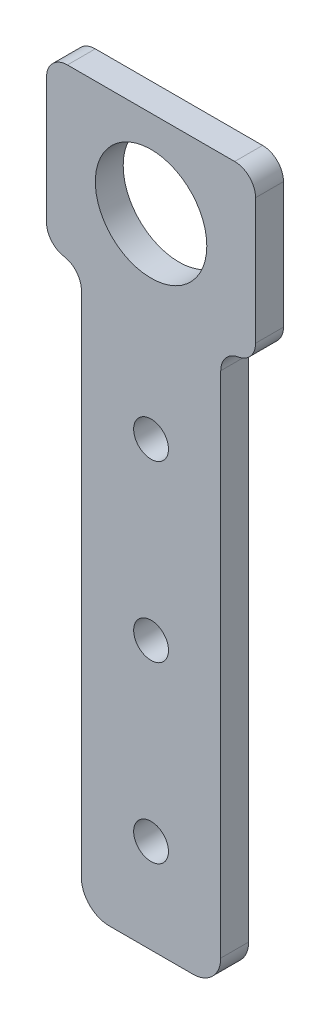
ISO-10303-21;
HEADER;
FILE_DESCRIPTION(('STEP AP214'),'2;1');
FILE_NAME('part.step','',(''),(''),'','','');
FILE_SCHEMA(('AUTOMOTIVE_DESIGN { 1 0 10303 214 1 1 1 1 }'));
ENDSEC;
DATA;
#1=APPLICATION_CONTEXT('core data for automotive mechanical design processes');
#2=APPLICATION_PROTOCOL_DEFINITION('international standard','automotive_design',2000,#1);
#3=PRODUCT_CONTEXT('',#1,'mechanical');
#4=PRODUCT('Part','Part','',(#3));
#5=PRODUCT_RELATED_PRODUCT_CATEGORY('part','',(#4));
#6=PRODUCT_DEFINITION_FORMATION('','',#4);
#7=PRODUCT_DEFINITION_CONTEXT('part definition',#1,'design');
#8=PRODUCT_DEFINITION('design','',#6,#7);
#9=PRODUCT_DEFINITION_SHAPE('','',#8);
#10=(LENGTH_UNIT() NAMED_UNIT(*) SI_UNIT(.MILLI.,.METRE.));
#11=(NAMED_UNIT(*) PLANE_ANGLE_UNIT() SI_UNIT($,.RADIAN.));
#12=(NAMED_UNIT(*) SI_UNIT($,.STERADIAN.) SOLID_ANGLE_UNIT());
#13=UNCERTAINTY_MEASURE_WITH_UNIT(LENGTH_MEASURE(1.E-05),#10,'distance_accuracy_value','');
#14=(GEOMETRIC_REPRESENTATION_CONTEXT(3) GLOBAL_UNCERTAINTY_ASSIGNED_CONTEXT((#13)) GLOBAL_UNIT_ASSIGNED_CONTEXT((#10,
#11,#12)) REPRESENTATION_CONTEXT('',''));
#15=CARTESIAN_POINT('',(0.,0.,0.));
#16=DIRECTION('',(0.,0.,1.));
#17=DIRECTION('',(1.,0.,0.));
#18=AXIS2_PLACEMENT_3D('',#15,#16,#17);
#19=CARTESIAN_POINT('',(-6.,-61.,4.));
#20=DIRECTION('',(0.,0.,-1.));
#21=DIRECTION('',(-1.,0.,0.));
#22=AXIS2_PLACEMENT_3D('',#19,#20,#21);
#23=CYLINDRICAL_SURFACE('',#22,4.);
#24=DIRECTION('',(0.,0.,1.));
#25=VECTOR('',#24,1.);
#26=CARTESIAN_POINT('',(-10.,-61.,4.));
#27=LINE('',#26,#25);
#28=CARTESIAN_POINT('',(-10.,-61.,0.));
#29=VERTEX_POINT('',#28);
#30=CARTESIAN_POINT('',(-10.,-61.,4.));
#31=VERTEX_POINT('',#30);
#32=EDGE_CURVE('E228',#29,#31,#27,.T.);
#33=ORIENTED_EDGE('',*,*,#32,.F.);
#34=CARTESIAN_POINT('',(-6.,-61.,0.));
#35=DIRECTION('',(0.,0.,-1.));
#36=DIRECTION('',(-1.,0.,0.));
#37=AXIS2_PLACEMENT_3D('',#34,#35,#36);
#38=CIRCLE('',#37,4.);
#39=CARTESIAN_POINT('',(-6.,-65.,0.));
#40=VERTEX_POINT('',#39);
#41=EDGE_CURVE('E40',#40,#29,#38,.T.);
#42=ORIENTED_EDGE('',*,*,#41,.F.);
#43=DIRECTION('',(0.,0.,1.));
#44=VECTOR('',#43,1.);
#45=CARTESIAN_POINT('',(-6.,-65.,4.));
#46=LINE('',#45,#44);
#47=CARTESIAN_POINT('',(-6.,-65.,4.));
#48=VERTEX_POINT('',#47);
#49=EDGE_CURVE('E231',#48,#40,#46,.F.);
#50=ORIENTED_EDGE('',*,*,#49,.F.);
#51=CARTESIAN_POINT('',(-6.,-61.,4.));
#52=DIRECTION('',(0.,0.,-1.));
#53=DIRECTION('',(-1.,0.,0.));
#54=AXIS2_PLACEMENT_3D('',#51,#52,#53);
#55=CIRCLE('',#54,4.);
#56=EDGE_CURVE('E11',#31,#48,#55,.F.);
#57=ORIENTED_EDGE('',*,*,#56,.F.);
#58=EDGE_LOOP('',(#33,#42,#50,#57));
#59=FACE_BOUND('',#58,.T.);
#60=ADVANCED_FACE('F33',(#59),#23,.T.);
#61=CARTESIAN_POINT('',(6.,-61.,-53.851648071345));
#62=DIRECTION('',(0.,0.,-1.));
#63=DIRECTION('',(-1.,0.,0.));
#64=AXIS2_PLACEMENT_3D('',#61,#62,#63);
#65=CYLINDRICAL_SURFACE('',#64,4.);
#66=DIRECTION('',(0.,0.,1.));
#67=VECTOR('',#66,1.);
#68=CARTESIAN_POINT('',(6.,-65.,-53.851648071345));
#69=LINE('',#68,#67);
#70=CARTESIAN_POINT('',(6.,-65.,0.));
#71=VERTEX_POINT('',#70);
#72=CARTESIAN_POINT('',(6.,-65.,4.));
#73=VERTEX_POINT('',#72);
#74=EDGE_CURVE('E212',#71,#73,#69,.T.);
#75=ORIENTED_EDGE('',*,*,#74,.F.);
#76=CARTESIAN_POINT('',(6.,-61.,0.));
#77=DIRECTION('',(0.,0.,-1.));
#78=DIRECTION('',(-1.,0.,0.));
#79=AXIS2_PLACEMENT_3D('',#76,#77,#78);
#80=CIRCLE('',#79,4.);
#81=CARTESIAN_POINT('',(10.,-61.,0.));
#82=VERTEX_POINT('',#81);
#83=EDGE_CURVE('E224',#82,#71,#80,.T.);
#84=ORIENTED_EDGE('',*,*,#83,.F.);
#85=DIRECTION('',(0.,0.,1.));
#86=VECTOR('',#85,1.);
#87=CARTESIAN_POINT('',(10.,-61.,-53.851648071345));
#88=LINE('',#87,#86);
#89=CARTESIAN_POINT('',(10.,-61.,4.));
#90=VERTEX_POINT('',#89);
#91=EDGE_CURVE('E139',#90,#82,#88,.F.);
#92=ORIENTED_EDGE('',*,*,#91,.F.);
#93=CARTESIAN_POINT('',(6.,-61.,4.));
#94=DIRECTION('',(0.,0.,-1.));
#95=DIRECTION('',(-1.,0.,0.));
#96=AXIS2_PLACEMENT_3D('',#93,#94,#95);
#97=CIRCLE('',#96,4.);
#98=EDGE_CURVE('E226',#73,#90,#97,.F.);
#99=ORIENTED_EDGE('',*,*,#98,.F.);
#100=EDGE_LOOP('',(#75,#84,#92,#99));
#101=FACE_BOUND('',#100,.T.);
#102=ADVANCED_FACE('F277',(#101),#65,.T.);
#103=CARTESIAN_POINT('',(0.,0.,4.));
#104=DIRECTION('',(0.,0.,-1.));
#105=DIRECTION('',(-1.,0.,0.));
#106=AXIS2_PLACEMENT_3D('',#103,#104,#105);
#107=PLANE('',#106);
#108=CARTESIAN_POINT('',(0.,-26.5,4.));
#109=DIRECTION('',(0.,0.,1.));
#110=DIRECTION('',(1.,0.,0.));
#111=AXIS2_PLACEMENT_3D('',#108,#109,#110);
#112=CIRCLE('',#111,2.5);
#113=CARTESIAN_POINT('',(2.5,-26.5,4.));
#114=VERTEX_POINT('',#113);
#115=EDGE_CURVE('E217',#114,#114,#112,.T.);
#116=ORIENTED_EDGE('',*,*,#115,.F.);
#117=EDGE_LOOP('',(#116));
#118=FACE_BOUND('',#117,.T.);
#119=CARTESIAN_POINT('',(0.,-51.5,4.));
#120=DIRECTION('',(0.,0.,1.));
#121=DIRECTION('',(1.,0.,0.));
#122=AXIS2_PLACEMENT_3D('',#119,#120,#121);
#123=CIRCLE('',#122,2.5);
#124=CARTESIAN_POINT('',(2.50000000000001,-51.5,4.));
#125=VERTEX_POINT('',#124);
#126=EDGE_CURVE('E266',#125,#125,#123,.T.);
#127=ORIENTED_EDGE('',*,*,#126,.F.);
#128=EDGE_LOOP('',(#127));
#129=FACE_BOUND('',#128,.T.);
#130=CARTESIAN_POINT('',(0.,-1.5,4.));
#131=DIRECTION('',(0.,0.,1.));
#132=DIRECTION('',(1.,0.,0.));
#133=AXIS2_PLACEMENT_3D('',#130,#131,#132);
#134=CIRCLE('',#133,2.5);
#135=CARTESIAN_POINT('',(2.5,-1.5,4.));
#136=VERTEX_POINT('',#135);
#137=EDGE_CURVE('E259',#136,#136,#134,.T.);
#138=ORIENTED_EDGE('',*,*,#137,.F.);
#139=EDGE_LOOP('',(#138));
#140=FACE_BOUND('',#139,.T.);
#141=CARTESIAN_POINT('',(0.,26.5,4.));
#142=DIRECTION('',(0.,0.,1.));
#143=DIRECTION('',(1.,0.,0.));
#144=AXIS2_PLACEMENT_3D('',#141,#142,#143);
#145=CIRCLE('',#144,8.);
#146=CARTESIAN_POINT('',(8.,26.5,4.));
#147=VERTEX_POINT('',#146);
#148=EDGE_CURVE('E177',#147,#147,#145,.T.);
#149=ORIENTED_EDGE('',*,*,#148,.F.);
#150=EDGE_LOOP('',(#149));
#151=FACE_BOUND('',#150,.T.);
#152=DIRECTION('',(0.,-1.,0.));
#153=VECTOR('',#152,1.);
#154=CARTESIAN_POINT('',(-10.,-15.,4.));
#155=LINE('',#154,#153);
#156=CARTESIAN_POINT('',(-10.,12.,4.));
#157=VERTEX_POINT('',#156);
#158=EDGE_CURVE('E158',#157,#31,#155,.T.);
#159=ORIENTED_EDGE('',*,*,#158,.T.);
#160=ORIENTED_EDGE('',*,*,#56,.T.);
#161=DIRECTION('',(1.,0.,0.));
#162=VECTOR('',#161,1.);
#163=CARTESIAN_POINT('',(10.,-65.,4.));
#164=LINE('',#163,#162);
#165=EDGE_CURVE('E220',#48,#73,#164,.T.);
#166=ORIENTED_EDGE('',*,*,#165,.T.);
#167=ORIENTED_EDGE('',*,*,#98,.T.);
#168=DIRECTION('',(0.,1.,0.));
#169=VECTOR('',#168,1.);
#170=CARTESIAN_POINT('',(10.,-15.,4.));
#171=LINE('',#170,#169);
#172=CARTESIAN_POINT('',(10.,12.,4.));
#173=VERTEX_POINT('',#172);
#174=EDGE_CURVE('E162',#90,#173,#171,.T.);
#175=ORIENTED_EDGE('',*,*,#174,.T.);
#176=CARTESIAN_POINT('',(13.,12.,4.));
#177=DIRECTION('',(0.,0.,-1.));
#178=DIRECTION('',(-1.,0.,0.));
#179=AXIS2_PLACEMENT_3D('',#176,#177,#178);
#180=CIRCLE('',#179,3.);
#181=CARTESIAN_POINT('',(12.5,14.9580398915498,4.));
#182=VERTEX_POINT('',#181);
#183=EDGE_CURVE('E153',#173,#182,#180,.T.);
#184=ORIENTED_EDGE('',*,*,#183,.T.);
#185=CARTESIAN_POINT('',(12.,17.9160797830996,4.));
#186=DIRECTION('',(0.,0.,-1.));
#187=DIRECTION('',(-1.,0.,0.));
#188=AXIS2_PLACEMENT_3D('',#185,#186,#187);
#189=CIRCLE('',#188,3.);
#190=CARTESIAN_POINT('',(15.,17.9160797830996,4.));
#191=VERTEX_POINT('',#190);
#192=EDGE_CURVE('E197',#182,#191,#189,.F.);
#193=ORIENTED_EDGE('',*,*,#192,.T.);
#194=DIRECTION('',(0.,-1.,0.));
#195=VECTOR('',#194,1.);
#196=CARTESIAN_POINT('',(15.,39.,4.));
#197=LINE('',#196,#195);
#198=CARTESIAN_POINT('',(15.,36.,4.));
#199=VERTEX_POINT('',#198);
#200=EDGE_CURVE('E248',#199,#191,#197,.T.);
#201=ORIENTED_EDGE('',*,*,#200,.F.);
#202=CARTESIAN_POINT('',(12.,36.,4.));
#203=DIRECTION('',(0.,0.,-1.));
#204=DIRECTION('',(-1.,0.,0.));
#205=AXIS2_PLACEMENT_3D('',#202,#203,#204);
#206=CIRCLE('',#205,3.);
#207=CARTESIAN_POINT('',(12.,39.,4.));
#208=VERTEX_POINT('',#207);
#209=EDGE_CURVE('E195',#199,#208,#206,.F.);
#210=ORIENTED_EDGE('',*,*,#209,.T.);
#211=DIRECTION('',(1.,0.,0.));
#212=VECTOR('',#211,1.);
#213=CARTESIAN_POINT('',(-15.,39.,4.));
#214=LINE('',#213,#212);
#215=CARTESIAN_POINT('',(-12.,39.,4.));
#216=VERTEX_POINT('',#215);
#217=EDGE_CURVE('E251',#216,#208,#214,.T.);
#218=ORIENTED_EDGE('',*,*,#217,.F.);
#219=CARTESIAN_POINT('',(-12.,36.,4.));
#220=DIRECTION('',(0.,0.,-1.));
#221=DIRECTION('',(-1.,0.,0.));
#222=AXIS2_PLACEMENT_3D('',#219,#220,#221);
#223=CIRCLE('',#222,3.);
#224=CARTESIAN_POINT('',(-15.,36.,4.));
#225=VERTEX_POINT('',#224);
#226=EDGE_CURVE('E193',#216,#225,#223,.F.);
#227=ORIENTED_EDGE('',*,*,#226,.T.);
#228=DIRECTION('',(0.,-1.,0.));
#229=VECTOR('',#228,1.);
#230=CARTESIAN_POINT('',(-15.,39.,4.));
#231=LINE('',#230,#229);
#232=CARTESIAN_POINT('',(-15.,17.9160797830996,4.));
#233=VERTEX_POINT('',#232);
#234=EDGE_CURVE('E245',#225,#233,#231,.T.);
#235=ORIENTED_EDGE('',*,*,#234,.T.);
#236=CARTESIAN_POINT('',(-12.,17.9160797830996,4.));
#237=DIRECTION('',(0.,0.,-1.));
#238=DIRECTION('',(-1.,0.,0.));
#239=AXIS2_PLACEMENT_3D('',#236,#237,#238);
#240=CIRCLE('',#239,3.);
#241=CARTESIAN_POINT('',(-12.5,14.9580398915498,4.));
#242=VERTEX_POINT('',#241);
#243=EDGE_CURVE('E191',#233,#242,#240,.F.);
#244=ORIENTED_EDGE('',*,*,#243,.T.);
#245=CARTESIAN_POINT('',(-13.,12.,4.));
#246=DIRECTION('',(0.,0.,-1.));
#247=DIRECTION('',(-1.,0.,0.));
#248=AXIS2_PLACEMENT_3D('',#245,#246,#247);
#249=CIRCLE('',#248,3.);
#250=EDGE_CURVE('E170',#242,#157,#249,.T.);
#251=ORIENTED_EDGE('',*,*,#250,.T.);
#252=EDGE_LOOP('',(#159,#160,#166,#167,#175,#184,#193,#201,#210,#218,#227,#235,#244,#251));
#253=FACE_BOUND('',#252,.T.);
#254=ADVANCED_FACE('F274',(#118,#129,#140,#151,#253),#107,.F.);
#255=CARTESIAN_POINT('',(0.,0.,0.));
#256=DIRECTION('',(0.,0.,-1.));
#257=DIRECTION('',(-1.,0.,0.));
#258=AXIS2_PLACEMENT_3D('',#255,#256,#257);
#259=PLANE('',#258);
#260=CARTESIAN_POINT('',(0.,-26.5,0.));
#261=DIRECTION('',(0.,0.,-1.));
#262=DIRECTION('',(-1.,0.,0.));
#263=AXIS2_PLACEMENT_3D('',#260,#261,#262);
#264=CIRCLE('',#263,2.5);
#265=CARTESIAN_POINT('',(-2.5,-26.5,0.));
#266=VERTEX_POINT('',#265);
#267=EDGE_CURVE('E216',#266,#266,#264,.T.);
#268=ORIENTED_EDGE('',*,*,#267,.F.);
#269=EDGE_LOOP('',(#268));
#270=FACE_BOUND('',#269,.T.);
#271=CARTESIAN_POINT('',(0.,-51.5,0.));
#272=DIRECTION('',(0.,0.,-1.));
#273=DIRECTION('',(-1.,0.,0.));
#274=AXIS2_PLACEMENT_3D('',#271,#272,#273);
#275=CIRCLE('',#274,2.5);
#276=CARTESIAN_POINT('',(-2.49999999999999,-51.5,0.));
#277=VERTEX_POINT('',#276);
#278=EDGE_CURVE('E213',#277,#277,#275,.T.);
#279=ORIENTED_EDGE('',*,*,#278,.F.);
#280=EDGE_LOOP('',(#279));
#281=FACE_BOUND('',#280,.T.);
#282=CARTESIAN_POINT('',(0.,-1.5,0.));
#283=DIRECTION('',(0.,0.,1.));
#284=DIRECTION('',(1.,0.,0.));
#285=AXIS2_PLACEMENT_3D('',#282,#283,#284);
#286=CIRCLE('',#285,2.5);
#287=CARTESIAN_POINT('',(2.5,-1.5,0.));
#288=VERTEX_POINT('',#287);
#289=EDGE_CURVE('E258',#288,#288,#286,.T.);
#290=ORIENTED_EDGE('',*,*,#289,.T.);
#291=EDGE_LOOP('',(#290));
#292=FACE_BOUND('',#291,.T.);
#293=CARTESIAN_POINT('',(0.,26.5,0.));
#294=DIRECTION('',(0.,0.,-1.));
#295=DIRECTION('',(-1.,0.,0.));
#296=AXIS2_PLACEMENT_3D('',#293,#294,#295);
#297=CIRCLE('',#296,8.);
#298=CARTESIAN_POINT('',(-8.,26.5,0.));
#299=VERTEX_POINT('',#298);
#300=EDGE_CURVE('E173',#299,#299,#297,.T.);
#301=ORIENTED_EDGE('',*,*,#300,.F.);
#302=EDGE_LOOP('',(#301));
#303=FACE_BOUND('',#302,.T.);
#304=DIRECTION('',(1.,0.,0.));
#305=VECTOR('',#304,1.);
#306=CARTESIAN_POINT('',(10.,-65.,0.));
#307=LINE('',#306,#305);
#308=EDGE_CURVE('E234',#40,#71,#307,.T.);
#309=ORIENTED_EDGE('',*,*,#308,.F.);
#310=ORIENTED_EDGE('',*,*,#41,.T.);
#311=DIRECTION('',(0.,-1.,0.));
#312=VECTOR('',#311,1.);
#313=CARTESIAN_POINT('',(-10.,-15.,0.));
#314=LINE('',#313,#312);
#315=CARTESIAN_POINT('',(-10.,12.,0.));
#316=VERTEX_POINT('',#315);
#317=EDGE_CURVE('E142',#316,#29,#314,.T.);
#318=ORIENTED_EDGE('',*,*,#317,.F.);
#319=CARTESIAN_POINT('',(-13.,12.,0.));
#320=DIRECTION('',(0.,0.,-1.));
#321=DIRECTION('',(-1.,0.,0.));
#322=AXIS2_PLACEMENT_3D('',#319,#320,#321);
#323=CIRCLE('',#322,3.);
#324=CARTESIAN_POINT('',(-12.5,14.9580398915498,0.));
#325=VERTEX_POINT('',#324);
#326=EDGE_CURVE('E167',#316,#325,#323,.F.);
#327=ORIENTED_EDGE('',*,*,#326,.T.);
#328=CARTESIAN_POINT('',(-12.,17.9160797830996,0.));
#329=DIRECTION('',(0.,0.,-1.));
#330=DIRECTION('',(-1.,0.,0.));
#331=AXIS2_PLACEMENT_3D('',#328,#329,#330);
#332=CIRCLE('',#331,3.);
#333=CARTESIAN_POINT('',(-15.,17.9160797830996,0.));
#334=VERTEX_POINT('',#333);
#335=EDGE_CURVE('E182',#325,#334,#332,.T.);
#336=ORIENTED_EDGE('',*,*,#335,.T.);
#337=DIRECTION('',(0.,-1.,0.));
#338=VECTOR('',#337,1.);
#339=CARTESIAN_POINT('',(-15.,39.,0.));
#340=LINE('',#339,#338);
#341=CARTESIAN_POINT('',(-15.,36.,0.));
#342=VERTEX_POINT('',#341);
#343=EDGE_CURVE('E242',#342,#334,#340,.T.);
#344=ORIENTED_EDGE('',*,*,#343,.F.);
#345=CARTESIAN_POINT('',(-12.,36.,0.));
#346=DIRECTION('',(0.,0.,-1.));
#347=DIRECTION('',(-1.,0.,0.));
#348=AXIS2_PLACEMENT_3D('',#345,#346,#347);
#349=CIRCLE('',#348,3.);
#350=CARTESIAN_POINT('',(-12.,39.,0.));
#351=VERTEX_POINT('',#350);
#352=EDGE_CURVE('E184',#342,#351,#349,.T.);
#353=ORIENTED_EDGE('',*,*,#352,.T.);
#354=DIRECTION('',(-1.,0.,0.));
#355=VECTOR('',#354,1.);
#356=CARTESIAN_POINT('',(-15.,39.,0.));
#357=LINE('',#356,#355);
#358=CARTESIAN_POINT('',(12.,39.,0.));
#359=VERTEX_POINT('',#358);
#360=EDGE_CURVE('E176',#359,#351,#357,.T.);
#361=ORIENTED_EDGE('',*,*,#360,.F.);
#362=CARTESIAN_POINT('',(12.,36.,0.));
#363=DIRECTION('',(0.,0.,-1.));
#364=DIRECTION('',(-1.,0.,0.));
#365=AXIS2_PLACEMENT_3D('',#362,#363,#364);
#366=CIRCLE('',#365,3.);
#367=CARTESIAN_POINT('',(15.,36.,0.));
#368=VERTEX_POINT('',#367);
#369=EDGE_CURVE('E186',#359,#368,#366,.T.);
#370=ORIENTED_EDGE('',*,*,#369,.T.);
#371=DIRECTION('',(0.,-1.,0.));
#372=VECTOR('',#371,1.);
#373=CARTESIAN_POINT('',(15.,39.,0.));
#374=LINE('',#373,#372);
#375=CARTESIAN_POINT('',(15.,17.9160797830996,0.));
#376=VERTEX_POINT('',#375);
#377=EDGE_CURVE('E143',#368,#376,#374,.T.);
#378=ORIENTED_EDGE('',*,*,#377,.T.);
#379=CARTESIAN_POINT('',(12.,17.9160797830996,0.));
#380=DIRECTION('',(0.,0.,-1.));
#381=DIRECTION('',(-1.,0.,0.));
#382=AXIS2_PLACEMENT_3D('',#379,#380,#381);
#383=CIRCLE('',#382,3.);
#384=CARTESIAN_POINT('',(12.5,14.9580398915498,0.));
#385=VERTEX_POINT('',#384);
#386=EDGE_CURVE('E150',#376,#385,#383,.T.);
#387=ORIENTED_EDGE('',*,*,#386,.T.);
#388=CARTESIAN_POINT('',(13.,12.,0.));
#389=DIRECTION('',(0.,0.,-1.));
#390=DIRECTION('',(-1.,0.,0.));
#391=AXIS2_PLACEMENT_3D('',#388,#389,#390);
#392=CIRCLE('',#391,3.);
#393=CARTESIAN_POINT('',(10.,12.,0.));
#394=VERTEX_POINT('',#393);
#395=EDGE_CURVE('E146',#385,#394,#392,.F.);
#396=ORIENTED_EDGE('',*,*,#395,.T.);
#397=DIRECTION('',(0.,1.,0.));
#398=VECTOR('',#397,1.);
#399=CARTESIAN_POINT('',(10.,-15.,0.));
#400=LINE('',#399,#398);
#401=EDGE_CURVE('E131',#82,#394,#400,.T.);
#402=ORIENTED_EDGE('',*,*,#401,.F.);
#403=ORIENTED_EDGE('',*,*,#83,.T.);
#404=EDGE_LOOP('',(#309,#310,#318,#327,#336,#344,#353,#361,#370,#378,#387,#396,#402,#403));
#405=FACE_BOUND('',#404,.T.);
#406=ADVANCED_FACE('F148',(#270,#281,#292,#303,#405),#259,.T.);
#407=CARTESIAN_POINT('',(10.,-15.,4.));
#408=DIRECTION('',(-1.,0.,0.));
#409=DIRECTION('',(0.,0.,1.));
#410=AXIS2_PLACEMENT_3D('',#407,#408,#409);
#411=PLANE('',#410);
#412=ORIENTED_EDGE('',*,*,#174,.F.);
#413=ORIENTED_EDGE('',*,*,#91,.T.);
#414=ORIENTED_EDGE('',*,*,#401,.T.);
#415=DIRECTION('',(0.,0.,-1.));
#416=VECTOR('',#415,1.);
#417=CARTESIAN_POINT('',(10.,12.,4.));
#418=LINE('',#417,#416);
#419=EDGE_CURVE('E136',#394,#173,#418,.F.);
#420=ORIENTED_EDGE('',*,*,#419,.T.);
#421=EDGE_LOOP('',(#412,#413,#414,#420));
#422=FACE_BOUND('',#421,.T.);
#423=ADVANCED_FACE('F134',(#422),#411,.F.);
#424=CARTESIAN_POINT('',(-10.,-15.,4.));
#425=DIRECTION('',(1.,0.,0.));
#426=DIRECTION('',(0.,0.,-1.));
#427=AXIS2_PLACEMENT_3D('',#424,#425,#426);
#428=PLANE('',#427);
#429=ORIENTED_EDGE('',*,*,#317,.T.);
#430=ORIENTED_EDGE('',*,*,#32,.T.);
#431=ORIENTED_EDGE('',*,*,#158,.F.);
#432=DIRECTION('',(0.,0.,-1.));
#433=VECTOR('',#432,1.);
#434=CARTESIAN_POINT('',(-10.,12.,0.));
#435=LINE('',#434,#433);
#436=EDGE_CURVE('E154',#157,#316,#435,.T.);
#437=ORIENTED_EDGE('',*,*,#436,.T.);
#438=EDGE_LOOP('',(#429,#430,#431,#437));
#439=FACE_BOUND('',#438,.T.);
#440=ADVANCED_FACE('F237',(#439),#428,.F.);
#441=CARTESIAN_POINT('',(15.,39.,0.));
#442=DIRECTION('',(-1.,0.,0.));
#443=DIRECTION('',(0.,0.,1.));
#444=AXIS2_PLACEMENT_3D('',#441,#442,#443);
#445=PLANE('',#444);
#446=ORIENTED_EDGE('',*,*,#200,.T.);
#447=DIRECTION('',(0.,0.,1.));
#448=VECTOR('',#447,1.);
#449=CARTESIAN_POINT('',(15.,17.9160797830996,0.));
#450=LINE('',#449,#448);
#451=EDGE_CURVE('E179',#191,#376,#450,.F.);
#452=ORIENTED_EDGE('',*,*,#451,.T.);
#453=ORIENTED_EDGE('',*,*,#377,.F.);
#454=DIRECTION('',(0.,0.,-1.));
#455=VECTOR('',#454,1.);
#456=CARTESIAN_POINT('',(15.,36.,4.));
#457=LINE('',#456,#455);
#458=EDGE_CURVE('E172',#368,#199,#457,.F.);
#459=ORIENTED_EDGE('',*,*,#458,.T.);
#460=EDGE_LOOP('',(#446,#452,#453,#459));
#461=FACE_BOUND('',#460,.T.);
#462=ADVANCED_FACE('F310',(#461),#445,.F.);
#463=CARTESIAN_POINT('',(-15.,39.,0.));
#464=DIRECTION('',(1.,0.,0.));
#465=DIRECTION('',(0.,0.,-1.));
#466=AXIS2_PLACEMENT_3D('',#463,#464,#465);
#467=PLANE('',#466);
#468=ORIENTED_EDGE('',*,*,#234,.F.);
#469=DIRECTION('',(0.,0.,1.));
#470=VECTOR('',#469,1.);
#471=CARTESIAN_POINT('',(-15.,36.,0.));
#472=LINE('',#471,#470);
#473=EDGE_CURVE('E208',#225,#342,#472,.F.);
#474=ORIENTED_EDGE('',*,*,#473,.T.);
#475=ORIENTED_EDGE('',*,*,#343,.T.);
#476=DIRECTION('',(0.,0.,1.));
#477=VECTOR('',#476,1.);
#478=CARTESIAN_POINT('',(-15.,17.9160797830996,0.));
#479=LINE('',#478,#477);
#480=EDGE_CURVE('E205',#334,#233,#479,.T.);
#481=ORIENTED_EDGE('',*,*,#480,.T.);
#482=EDGE_LOOP('',(#468,#474,#475,#481));
#483=FACE_BOUND('',#482,.T.);
#484=ADVANCED_FACE('F295',(#483),#467,.F.);
#485=CARTESIAN_POINT('',(0.,39.,0.));
#486=DIRECTION('',(0.,1.,0.));
#487=DIRECTION('',(0.,0.,1.));
#488=AXIS2_PLACEMENT_3D('',#485,#486,#487);
#489=PLANE('',#488);
#490=ORIENTED_EDGE('',*,*,#217,.T.);
#491=DIRECTION('',(0.,0.,-1.));
#492=VECTOR('',#491,1.);
#493=CARTESIAN_POINT('',(12.,39.,0.));
#494=LINE('',#493,#492);
#495=EDGE_CURVE('E202',#208,#359,#494,.T.);
#496=ORIENTED_EDGE('',*,*,#495,.T.);
#497=ORIENTED_EDGE('',*,*,#360,.T.);
#498=DIRECTION('',(0.,0.,1.));
#499=VECTOR('',#498,1.);
#500=CARTESIAN_POINT('',(-12.,39.,4.));
#501=LINE('',#500,#499);
#502=EDGE_CURVE('E199',#351,#216,#501,.T.);
#503=ORIENTED_EDGE('',*,*,#502,.T.);
#504=EDGE_LOOP('',(#490,#496,#497,#503));
#505=FACE_BOUND('',#504,.T.);
#506=ADVANCED_FACE('F303',(#505),#489,.T.);
#507=CARTESIAN_POINT('',(13.,12.,0.));
#508=DIRECTION('',(0.,0.,1.));
#509=DIRECTION('',(1.,0.,0.));
#510=AXIS2_PLACEMENT_3D('',#507,#508,#509);
#511=CYLINDRICAL_SURFACE('',#510,3.);
#512=ORIENTED_EDGE('',*,*,#395,.F.);
#513=DIRECTION('',(0.,0.,1.));
#514=VECTOR('',#513,1.);
#515=CARTESIAN_POINT('',(12.5,14.9580398915498,0.));
#516=LINE('',#515,#514);
#517=EDGE_CURVE('E189',#385,#182,#516,.T.);
#518=ORIENTED_EDGE('',*,*,#517,.T.);
#519=ORIENTED_EDGE('',*,*,#183,.F.);
#520=ORIENTED_EDGE('',*,*,#419,.F.);
#521=EDGE_LOOP('',(#512,#518,#519,#520));
#522=FACE_BOUND('',#521,.T.);
#523=ADVANCED_FACE('F156',(#522),#511,.F.);
#524=CARTESIAN_POINT('',(-13.,12.,4.));
#525=DIRECTION('',(0.,0.,1.));
#526=DIRECTION('',(1.,0.,0.));
#527=AXIS2_PLACEMENT_3D('',#524,#525,#526);
#528=CYLINDRICAL_SURFACE('',#527,3.);
#529=ORIENTED_EDGE('',*,*,#250,.F.);
#530=DIRECTION('',(0.,0.,1.));
#531=VECTOR('',#530,1.);
#532=CARTESIAN_POINT('',(-12.5,14.9580398915498,4.));
#533=LINE('',#532,#531);
#534=EDGE_CURVE('E210',#242,#325,#533,.F.);
#535=ORIENTED_EDGE('',*,*,#534,.T.);
#536=ORIENTED_EDGE('',*,*,#326,.F.);
#537=ORIENTED_EDGE('',*,*,#436,.F.);
#538=EDGE_LOOP('',(#529,#535,#536,#537));
#539=FACE_BOUND('',#538,.T.);
#540=ADVANCED_FACE('F286',(#539),#528,.F.);
#541=CARTESIAN_POINT('',(0.,26.5,-20.));
#542=DIRECTION('',(0.,0.,1.));
#543=DIRECTION('',(1.,0.,0.));
#544=AXIS2_PLACEMENT_3D('',#541,#542,#543);
#545=CYLINDRICAL_SURFACE('',#544,8.);
#546=ORIENTED_EDGE('',*,*,#300,.T.);
#547=EDGE_LOOP('',(#546));
#548=FACE_BOUND('',#547,.T.);
#549=ORIENTED_EDGE('',*,*,#148,.T.);
#550=EDGE_LOOP('',(#549));
#551=FACE_BOUND('',#550,.T.);
#552=ADVANCED_FACE('F319',(#548,#551),#545,.F.);
#553=CARTESIAN_POINT('',(12.,17.9160797830996,0.));
#554=DIRECTION('',(0.,0.,1.));
#555=DIRECTION('',(1.,0.,0.));
#556=AXIS2_PLACEMENT_3D('',#553,#554,#555);
#557=CYLINDRICAL_SURFACE('',#556,3.);
#558=ORIENTED_EDGE('',*,*,#192,.F.);
#559=ORIENTED_EDGE('',*,*,#517,.F.);
#560=ORIENTED_EDGE('',*,*,#386,.F.);
#561=ORIENTED_EDGE('',*,*,#451,.F.);
#562=EDGE_LOOP('',(#558,#559,#560,#561));
#563=FACE_BOUND('',#562,.T.);
#564=ADVANCED_FACE('F317',(#563),#557,.T.);
#565=CARTESIAN_POINT('',(12.,36.,0.));
#566=DIRECTION('',(0.,0.,1.));
#567=DIRECTION('',(1.,0.,0.));
#568=AXIS2_PLACEMENT_3D('',#565,#566,#567);
#569=CYLINDRICAL_SURFACE('',#568,3.);
#570=ORIENTED_EDGE('',*,*,#209,.F.);
#571=ORIENTED_EDGE('',*,*,#458,.F.);
#572=ORIENTED_EDGE('',*,*,#369,.F.);
#573=ORIENTED_EDGE('',*,*,#495,.F.);
#574=EDGE_LOOP('',(#570,#571,#572,#573));
#575=FACE_BOUND('',#574,.T.);
#576=ADVANCED_FACE('F314',(#575),#569,.T.);
#577=CARTESIAN_POINT('',(-12.,36.,0.));
#578=DIRECTION('',(0.,0.,-1.));
#579=DIRECTION('',(-1.,0.,0.));
#580=AXIS2_PLACEMENT_3D('',#577,#578,#579);
#581=CYLINDRICAL_SURFACE('',#580,3.);
#582=ORIENTED_EDGE('',*,*,#352,.F.);
#583=ORIENTED_EDGE('',*,*,#473,.F.);
#584=ORIENTED_EDGE('',*,*,#226,.F.);
#585=ORIENTED_EDGE('',*,*,#502,.F.);
#586=EDGE_LOOP('',(#582,#583,#584,#585));
#587=FACE_BOUND('',#586,.T.);
#588=ADVANCED_FACE('F301',(#587),#581,.T.);
#589=CARTESIAN_POINT('',(-12.,17.9160797830996,4.));
#590=DIRECTION('',(0.,0.,1.));
#591=DIRECTION('',(1.,0.,0.));
#592=AXIS2_PLACEMENT_3D('',#589,#590,#591);
#593=CYLINDRICAL_SURFACE('',#592,3.);
#594=ORIENTED_EDGE('',*,*,#335,.F.);
#595=ORIENTED_EDGE('',*,*,#534,.F.);
#596=ORIENTED_EDGE('',*,*,#243,.F.);
#597=ORIENTED_EDGE('',*,*,#480,.F.);
#598=EDGE_LOOP('',(#594,#595,#596,#597));
#599=FACE_BOUND('',#598,.T.);
#600=ADVANCED_FACE('F292',(#599),#593,.T.);
#601=CARTESIAN_POINT('',(0.,-1.5,0.));
#602=DIRECTION('',(0.,0.,1.));
#603=DIRECTION('',(1.,0.,0.));
#604=AXIS2_PLACEMENT_3D('',#601,#602,#603);
#605=CYLINDRICAL_SURFACE('',#604,2.5);
#606=ORIENTED_EDGE('',*,*,#289,.F.);
#607=EDGE_LOOP('',(#606));
#608=FACE_BOUND('',#607,.T.);
#609=ORIENTED_EDGE('',*,*,#137,.T.);
#610=EDGE_LOOP('',(#609));
#611=FACE_BOUND('',#610,.T.);
#612=ADVANCED_FACE('F340',(#608,#611),#605,.F.);
#613=CARTESIAN_POINT('',(10.,-65.,-53.851648071345));
#614=DIRECTION('',(0.,-1.,0.));
#615=DIRECTION('',(0.,0.,-1.));
#616=AXIS2_PLACEMENT_3D('',#613,#614,#615);
#617=PLANE('',#616);
#618=ORIENTED_EDGE('',*,*,#165,.F.);
#619=ORIENTED_EDGE('',*,*,#49,.T.);
#620=ORIENTED_EDGE('',*,*,#308,.T.);
#621=ORIENTED_EDGE('',*,*,#74,.T.);
#622=EDGE_LOOP('',(#618,#619,#620,#621));
#623=FACE_BOUND('',#622,.T.);
#624=ADVANCED_FACE('F360',(#623),#617,.T.);
#625=CARTESIAN_POINT('',(0.,-51.5,-6.));
#626=DIRECTION('',(0.,0.,1.));
#627=DIRECTION('',(1.,0.,0.));
#628=AXIS2_PLACEMENT_3D('',#625,#626,#627);
#629=CYLINDRICAL_SURFACE('',#628,2.5);
#630=ORIENTED_EDGE('',*,*,#278,.T.);
#631=EDGE_LOOP('',(#630));
#632=FACE_BOUND('',#631,.T.);
#633=ORIENTED_EDGE('',*,*,#126,.T.);
#634=EDGE_LOOP('',(#633));
#635=FACE_BOUND('',#634,.T.);
#636=ADVANCED_FACE('F370',(#632,#635),#629,.F.);
#637=CARTESIAN_POINT('',(0.,-26.5,-6.));
#638=DIRECTION('',(0.,0.,1.));
#639=DIRECTION('',(1.,0.,0.));
#640=AXIS2_PLACEMENT_3D('',#637,#638,#639);
#641=CYLINDRICAL_SURFACE('',#640,2.5);
#642=ORIENTED_EDGE('',*,*,#267,.T.);
#643=EDGE_LOOP('',(#642));
#644=FACE_BOUND('',#643,.T.);
#645=ORIENTED_EDGE('',*,*,#115,.T.);
#646=EDGE_LOOP('',(#645));
#647=FACE_BOUND('',#646,.T.);
#648=ADVANCED_FACE('F272',(#644,#647),#641,.F.);
#649=CLOSED_SHELL('',(#60,#102,#254,#406,#423,#440,#462,#484,#506,#523,#540,#552,#564,#576,#588,
#600,#612,#624,#636,#648));
#650=MANIFOLD_SOLID_BREP('B2',#649);
#651=ADVANCED_BREP_SHAPE_REPRESENTATION('',(#18,#650),#14);
#652=SHAPE_DEFINITION_REPRESENTATION(#9,#651);
ENDSEC;
END-ISO-10303-21;
